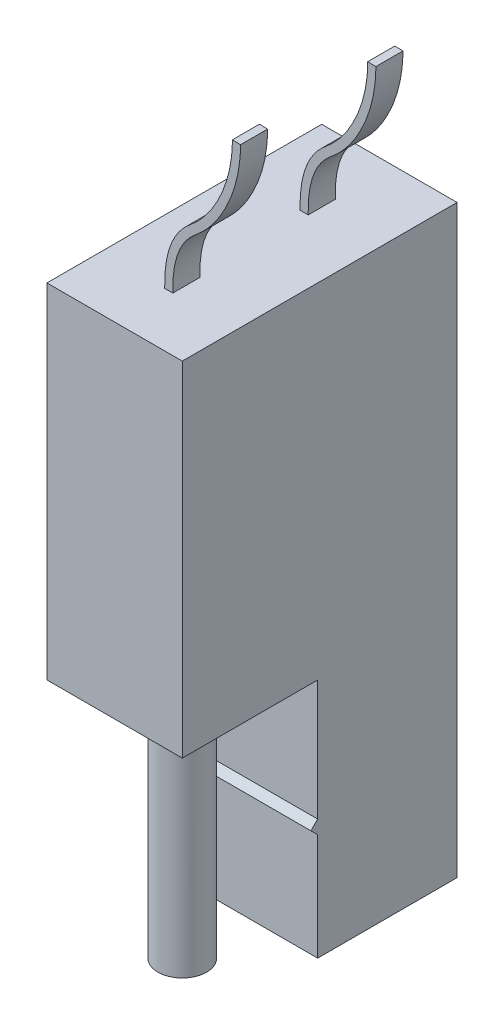
ISO-10303-21;
HEADER;
FILE_DESCRIPTION(('STEP AP214'),'2;1');
FILE_NAME('part.step','',(''),(''),'','','');
FILE_SCHEMA(('AUTOMOTIVE_DESIGN { 1 0 10303 214 1 1 1 1 }'));
ENDSEC;
DATA;
#1=APPLICATION_CONTEXT('core data for automotive mechanical design processes');
#2=APPLICATION_PROTOCOL_DEFINITION('international standard','automotive_design',2000,#1);
#3=PRODUCT_CONTEXT('',#1,'mechanical');
#4=PRODUCT('Part','Part','',(#3));
#5=PRODUCT_RELATED_PRODUCT_CATEGORY('part','',(#4));
#6=PRODUCT_DEFINITION_FORMATION('','',#4);
#7=PRODUCT_DEFINITION_CONTEXT('part definition',#1,'design');
#8=PRODUCT_DEFINITION('design','',#6,#7);
#9=PRODUCT_DEFINITION_SHAPE('','',#8);
#10=(LENGTH_UNIT() NAMED_UNIT(*) SI_UNIT(.MILLI.,.METRE.));
#11=(NAMED_UNIT(*) PLANE_ANGLE_UNIT() SI_UNIT($,.RADIAN.));
#12=(NAMED_UNIT(*) SI_UNIT($,.STERADIAN.) SOLID_ANGLE_UNIT());
#13=UNCERTAINTY_MEASURE_WITH_UNIT(LENGTH_MEASURE(1.E-05),#10,'distance_accuracy_value','');
#14=(GEOMETRIC_REPRESENTATION_CONTEXT(3) GLOBAL_UNCERTAINTY_ASSIGNED_CONTEXT((#13)) GLOBAL_UNIT_ASSIGNED_CONTEXT((#10,
#11,#12)) REPRESENTATION_CONTEXT('',''));
#15=CARTESIAN_POINT('',(0.,0.,0.));
#16=DIRECTION('',(0.,0.,1.));
#17=DIRECTION('',(1.,0.,0.));
#18=AXIS2_PLACEMENT_3D('',#15,#16,#17);
#19=CARTESIAN_POINT('',(0.,0.,1.03));
#20=DIRECTION('',(0.,0.,-1.));
#21=DIRECTION('',(-1.,0.,0.));
#22=AXIS2_PLACEMENT_3D('',#19,#20,#21);
#23=PLANE('',#22);
#24=DIRECTION('',(0.,1.,0.));
#25=VECTOR('',#24,1.);
#26=CARTESIAN_POINT('',(0.5,-2.16,1.03));
#27=LINE('',#26,#25);
#28=CARTESIAN_POINT('',(0.5,-2.16,1.03));
#29=VERTEX_POINT('',#28);
#30=CARTESIAN_POINT('',(0.5,-1.37,1.03));
#31=VERTEX_POINT('',#30);
#32=EDGE_CURVE('E64',#29,#31,#27,.T.);
#33=ORIENTED_EDGE('',*,*,#32,.T.);
#34=DIRECTION('',(1.,0.,0.));
#35=VECTOR('',#34,1.);
#36=CARTESIAN_POINT('',(-0.61180339887499,-1.37,1.03));
#37=LINE('',#36,#35);
#38=CARTESIAN_POINT('',(-0.5,-1.37,1.03));
#39=VERTEX_POINT('',#38);
#40=EDGE_CURVE('E171',#39,#31,#37,.T.);
#41=ORIENTED_EDGE('',*,*,#40,.F.);
#42=DIRECTION('',(0.,-1.,0.));
#43=VECTOR('',#42,1.);
#44=CARTESIAN_POINT('',(-0.5,-2.16,1.03));
#45=LINE('',#44,#43);
#46=CARTESIAN_POINT('',(-0.5,-2.16,1.03));
#47=VERTEX_POINT('',#46);
#48=EDGE_CURVE('E308',#39,#47,#45,.T.);
#49=ORIENTED_EDGE('',*,*,#48,.T.);
#50=DIRECTION('',(1.,0.,0.));
#51=VECTOR('',#50,1.);
#52=CARTESIAN_POINT('',(-0.5,-2.16,1.03));
#53=LINE('',#52,#51);
#54=EDGE_CURVE('E307',#47,#29,#53,.T.);
#55=ORIENTED_EDGE('',*,*,#54,.T.);
#56=EDGE_LOOP('',(#33,#41,#49,#55));
#57=FACE_BOUND('',#56,.T.);
#58=ADVANCED_FACE('F41',(#57),#23,.F.);
#59=CARTESIAN_POINT('',(-0.5,2.16,2.03));
#60=DIRECTION('',(0.,-1.,0.));
#61=DIRECTION('',(0.,0.,-1.));
#62=AXIS2_PLACEMENT_3D('',#59,#60,#61);
#63=PLANE('',#62);
#64=DIRECTION('',(-1.,0.,0.));
#65=VECTOR('',#64,1.);
#66=CARTESIAN_POINT('',(-0.0299999999999999,2.16,0.629999999999999));
#67=LINE('',#66,#65);
#68=CARTESIAN_POINT('',(-0.0299999999999999,2.16,0.629999999999999));
#69=VERTEX_POINT('',#68);
#70=CARTESIAN_POINT('',(0.0300000000000001,2.16,0.629999999999999));
#71=VERTEX_POINT('',#70);
#72=EDGE_CURVE('E190',#69,#71,#67,.F.);
#73=ORIENTED_EDGE('',*,*,#72,.F.);
#74=DIRECTION('',(0.,0.,-1.));
#75=VECTOR('',#74,1.);
#76=CARTESIAN_POINT('',(-0.0299999999999999,2.16,0.429999999999999));
#77=LINE('',#76,#75);
#78=CARTESIAN_POINT('',(-0.0299999999999999,2.16,0.429999999999999));
#79=VERTEX_POINT('',#78);
#80=EDGE_CURVE('E188',#79,#69,#77,.F.);
#81=ORIENTED_EDGE('',*,*,#80,.F.);
#82=DIRECTION('',(1.,0.,0.));
#83=VECTOR('',#82,1.);
#84=CARTESIAN_POINT('',(-0.0299999999999999,2.16,0.429999999999999));
#85=LINE('',#84,#83);
#86=CARTESIAN_POINT('',(0.0300000000000001,2.16,0.429999999999999));
#87=VERTEX_POINT('',#86);
#88=EDGE_CURVE('E209',#87,#79,#85,.F.);
#89=ORIENTED_EDGE('',*,*,#88,.F.);
#90=DIRECTION('',(0.,0.,1.));
#91=VECTOR('',#90,1.);
#92=CARTESIAN_POINT('',(0.0300000000000001,2.16,0.429999999999999));
#93=LINE('',#92,#91);
#94=EDGE_CURVE('E214',#71,#87,#93,.F.);
#95=ORIENTED_EDGE('',*,*,#94,.F.);
#96=EDGE_LOOP('',(#73,#81,#89,#95));
#97=FACE_BOUND('',#96,.T.);
#98=DIRECTION('',(-1.,0.,0.));
#99=VECTOR('',#98,1.);
#100=CARTESIAN_POINT('',(-0.5,2.16,0.));
#101=LINE('',#100,#99);
#102=CARTESIAN_POINT('',(0.5,2.16,0.));
#103=VERTEX_POINT('',#102);
#104=CARTESIAN_POINT('',(-0.5,2.16,0.));
#105=VERTEX_POINT('',#104);
#106=EDGE_CURVE('E332',#103,#105,#101,.T.);
#107=ORIENTED_EDGE('',*,*,#106,.T.);
#108=DIRECTION('',(0.,0.,-1.));
#109=VECTOR('',#108,1.);
#110=CARTESIAN_POINT('',(-0.5,2.16,2.03));
#111=LINE('',#110,#109);
#112=CARTESIAN_POINT('',(-0.5,2.16,2.03));
#113=VERTEX_POINT('',#112);
#114=EDGE_CURVE('E342',#113,#105,#111,.T.);
#115=ORIENTED_EDGE('',*,*,#114,.F.);
#116=DIRECTION('',(-1.,0.,0.));
#117=VECTOR('',#116,1.);
#118=CARTESIAN_POINT('',(-0.5,2.16,2.03));
#119=LINE('',#118,#117);
#120=CARTESIAN_POINT('',(0.5,2.16,2.03));
#121=VERTEX_POINT('',#120);
#122=EDGE_CURVE('E323',#121,#113,#119,.T.);
#123=ORIENTED_EDGE('',*,*,#122,.F.);
#124=DIRECTION('',(0.,0.,-1.));
#125=VECTOR('',#124,1.);
#126=CARTESIAN_POINT('',(0.5,2.16,2.03));
#127=LINE('',#126,#125);
#128=EDGE_CURVE('E49',#121,#103,#127,.T.);
#129=ORIENTED_EDGE('',*,*,#128,.T.);
#130=EDGE_LOOP('',(#107,#115,#123,#129));
#131=FACE_BOUND('',#130,.T.);
#132=DIRECTION('',(0.,0.,-1.));
#133=VECTOR('',#132,1.);
#134=CARTESIAN_POINT('',(0.0300000000000001,2.16,1.63));
#135=LINE('',#134,#133);
#136=CARTESIAN_POINT('',(0.0300000000000001,2.16,1.63));
#137=VERTEX_POINT('',#136);
#138=CARTESIAN_POINT('',(0.0300000000000001,2.16,1.43));
#139=VERTEX_POINT('',#138);
#140=EDGE_CURVE('E237',#137,#139,#135,.T.);
#141=ORIENTED_EDGE('',*,*,#140,.F.);
#142=DIRECTION('',(1.,0.,0.));
#143=VECTOR('',#142,1.);
#144=CARTESIAN_POINT('',(-0.0299999999999999,2.16,1.63));
#145=LINE('',#144,#143);
#146=CARTESIAN_POINT('',(-0.0299999999999999,2.16,1.63));
#147=VERTEX_POINT('',#146);
#148=EDGE_CURVE('E259',#147,#137,#145,.T.);
#149=ORIENTED_EDGE('',*,*,#148,.F.);
#150=DIRECTION('',(0.,0.,1.));
#151=VECTOR('',#150,1.);
#152=CARTESIAN_POINT('',(-0.0299999999999999,2.16,1.63));
#153=LINE('',#152,#151);
#154=CARTESIAN_POINT('',(-0.0299999999999999,2.16,1.43));
#155=VERTEX_POINT('',#154);
#156=EDGE_CURVE('E265',#155,#147,#153,.T.);
#157=ORIENTED_EDGE('',*,*,#156,.F.);
#158=DIRECTION('',(-1.,0.,0.));
#159=VECTOR('',#158,1.);
#160=CARTESIAN_POINT('',(-0.0299999999999999,2.16,1.43));
#161=LINE('',#160,#159);
#162=EDGE_CURVE('E240',#139,#155,#161,.T.);
#163=ORIENTED_EDGE('',*,*,#162,.F.);
#164=EDGE_LOOP('',(#141,#149,#157,#163));
#165=FACE_BOUND('',#164,.T.);
#166=ADVANCED_FACE('F348',(#97,#131,#165),#63,.F.);
#167=CARTESIAN_POINT('',(0.5,-2.16,2.03));
#168=DIRECTION('',(-1.,0.,0.));
#169=DIRECTION('',(0.,0.,1.));
#170=AXIS2_PLACEMENT_3D('',#167,#168,#169);
#171=PLANE('',#170);
#172=DIRECTION('',(0.,1.,0.));
#173=VECTOR('',#172,1.);
#174=CARTESIAN_POINT('',(0.5,-2.16,2.03));
#175=LINE('',#174,#173);
#176=CARTESIAN_POINT('',(0.5,-0.38,2.03));
#177=VERTEX_POINT('',#176);
#178=EDGE_CURVE('E321',#177,#121,#175,.T.);
#179=ORIENTED_EDGE('',*,*,#178,.F.);
#180=DIRECTION('',(0.,0.,1.));
#181=VECTOR('',#180,1.);
#182=CARTESIAN_POINT('',(0.5,-0.38,1.03));
#183=LINE('',#182,#181);
#184=CARTESIAN_POINT('',(0.5,-0.38,1.03));
#185=VERTEX_POINT('',#184);
#186=EDGE_CURVE('E314',#185,#177,#183,.T.);
#187=ORIENTED_EDGE('',*,*,#186,.F.);
#188=CARTESIAN_POINT('',(0.5,-1.27,1.03));
#189=VERTEX_POINT('',#188);
#190=EDGE_CURVE('E178',#189,#185,#27,.T.);
#191=ORIENTED_EDGE('',*,*,#190,.F.);
#192=DIRECTION('',(0.,-0.707106781186546,0.707106781186549));
#193=VECTOR('',#192,1.);
#194=CARTESIAN_POINT('',(0.5,-1.27,1.03));
#195=LINE('',#194,#193);
#196=CARTESIAN_POINT('',(0.5,-1.32,1.08));
#197=VERTEX_POINT('',#196);
#198=EDGE_CURVE('E165',#189,#197,#195,.T.);
#199=ORIENTED_EDGE('',*,*,#198,.T.);
#200=DIRECTION('',(0.,-0.707106781186546,-0.707106781186549));
#201=VECTOR('',#200,1.);
#202=CARTESIAN_POINT('',(0.5,-1.32,1.08));
#203=LINE('',#202,#201);
#204=EDGE_CURVE('E176',#197,#31,#203,.T.);
#205=ORIENTED_EDGE('',*,*,#204,.T.);
#206=ORIENTED_EDGE('',*,*,#32,.F.);
#207=DIRECTION('',(0.,0.,-1.));
#208=VECTOR('',#207,1.);
#209=CARTESIAN_POINT('',(0.5,-2.16,2.03));
#210=LINE('',#209,#208);
#211=CARTESIAN_POINT('',(0.5,-2.16,0.));
#212=VERTEX_POINT('',#211);
#213=EDGE_CURVE('E329',#29,#212,#210,.T.);
#214=ORIENTED_EDGE('',*,*,#213,.T.);
#215=DIRECTION('',(0.,1.,0.));
#216=VECTOR('',#215,1.);
#217=CARTESIAN_POINT('',(0.5,-2.16,0.));
#218=LINE('',#217,#216);
#219=EDGE_CURVE('E319',#212,#103,#218,.T.);
#220=ORIENTED_EDGE('',*,*,#219,.T.);
#221=ORIENTED_EDGE('',*,*,#128,.F.);
#222=EDGE_LOOP('',(#179,#187,#191,#199,#205,#206,#214,#220,#221));
#223=FACE_BOUND('',#222,.T.);
#224=ADVANCED_FACE('F43',(#223),#171,.F.);
#225=CARTESIAN_POINT('',(-0.5,-2.16,2.03));
#226=DIRECTION('',(1.,0.,0.));
#227=DIRECTION('',(0.,0.,-1.));
#228=AXIS2_PLACEMENT_3D('',#225,#226,#227);
#229=PLANE('',#228);
#230=CARTESIAN_POINT('',(-0.5,-0.38,1.03));
#231=VERTEX_POINT('',#230);
#232=CARTESIAN_POINT('',(-0.5,-1.27,1.03));
#233=VERTEX_POINT('',#232);
#234=EDGE_CURVE('E305',#231,#233,#45,.T.);
#235=ORIENTED_EDGE('',*,*,#234,.F.);
#236=DIRECTION('',(0.,0.,1.));
#237=VECTOR('',#236,1.);
#238=CARTESIAN_POINT('',(-0.5,-0.38,1.03));
#239=LINE('',#238,#237);
#240=CARTESIAN_POINT('',(-0.5,-0.38,2.03));
#241=VERTEX_POINT('',#240);
#242=EDGE_CURVE('E316',#231,#241,#239,.T.);
#243=ORIENTED_EDGE('',*,*,#242,.T.);
#244=DIRECTION('',(0.,-1.,0.));
#245=VECTOR('',#244,1.);
#246=CARTESIAN_POINT('',(-0.5,-2.16,2.03));
#247=LINE('',#246,#245);
#248=EDGE_CURVE('E326',#113,#241,#247,.T.);
#249=ORIENTED_EDGE('',*,*,#248,.F.);
#250=ORIENTED_EDGE('',*,*,#114,.T.);
#251=DIRECTION('',(0.,-1.,0.));
#252=VECTOR('',#251,1.);
#253=CARTESIAN_POINT('',(-0.5,-2.16,0.));
#254=LINE('',#253,#252);
#255=CARTESIAN_POINT('',(-0.5,-2.16,0.));
#256=VERTEX_POINT('',#255);
#257=EDGE_CURVE('E334',#105,#256,#254,.T.);
#258=ORIENTED_EDGE('',*,*,#257,.T.);
#259=DIRECTION('',(0.,0.,-1.));
#260=VECTOR('',#259,1.);
#261=CARTESIAN_POINT('',(-0.5,-2.16,2.03));
#262=LINE('',#261,#260);
#263=EDGE_CURVE('E340',#47,#256,#262,.T.);
#264=ORIENTED_EDGE('',*,*,#263,.F.);
#265=ORIENTED_EDGE('',*,*,#48,.F.);
#266=DIRECTION('',(0.,0.707106781186546,0.707106781186549));
#267=VECTOR('',#266,1.);
#268=CARTESIAN_POINT('',(-0.5,-1.32,1.08));
#269=LINE('',#268,#267);
#270=CARTESIAN_POINT('',(-0.5,-1.32,1.08));
#271=VERTEX_POINT('',#270);
#272=EDGE_CURVE('E185',#39,#271,#269,.T.);
#273=ORIENTED_EDGE('',*,*,#272,.T.);
#274=DIRECTION('',(0.,0.707106781186546,-0.707106781186549));
#275=VECTOR('',#274,1.);
#276=CARTESIAN_POINT('',(-0.5,-1.27,1.03));
#277=LINE('',#276,#275);
#278=EDGE_CURVE('E167',#271,#233,#277,.T.);
#279=ORIENTED_EDGE('',*,*,#278,.T.);
#280=EDGE_LOOP('',(#235,#243,#249,#250,#258,#264,#265,#273,#279));
#281=FACE_BOUND('',#280,.T.);
#282=ADVANCED_FACE('F360',(#281),#229,.F.);
#283=CARTESIAN_POINT('',(-0.5,-2.16,2.03));
#284=DIRECTION('',(0.,1.,0.));
#285=DIRECTION('',(0.,0.,1.));
#286=AXIS2_PLACEMENT_3D('',#283,#284,#285);
#287=PLANE('',#286);
#288=CARTESIAN_POINT('',(0.,-2.16,0.53));
#289=DIRECTION('',(0.,-1.,0.));
#290=DIRECTION('',(0.,0.,-1.));
#291=AXIS2_PLACEMENT_3D('',#288,#289,#290);
#292=CIRCLE('',#291,0.19);
#293=CARTESIAN_POINT('',(0.,-2.16,0.34));
#294=VERTEX_POINT('',#293);
#295=EDGE_CURVE('E290',#294,#294,#292,.T.);
#296=ORIENTED_EDGE('',*,*,#295,.F.);
#297=EDGE_LOOP('',(#296));
#298=FACE_BOUND('',#297,.T.);
#299=ORIENTED_EDGE('',*,*,#213,.F.);
#300=ORIENTED_EDGE('',*,*,#54,.F.);
#301=ORIENTED_EDGE('',*,*,#263,.T.);
#302=DIRECTION('',(1.,0.,0.));
#303=VECTOR('',#302,1.);
#304=CARTESIAN_POINT('',(-0.5,-2.16,0.));
#305=LINE('',#304,#303);
#306=EDGE_CURVE('E324',#256,#212,#305,.T.);
#307=ORIENTED_EDGE('',*,*,#306,.T.);
#308=EDGE_LOOP('',(#299,#300,#301,#307));
#309=FACE_BOUND('',#308,.T.);
#310=ADVANCED_FACE('F517',(#298,#309),#287,.F.);
#311=CARTESIAN_POINT('',(0.,0.,2.03));
#312=DIRECTION('',(0.,0.,-1.));
#313=DIRECTION('',(-1.,0.,0.));
#314=AXIS2_PLACEMENT_3D('',#311,#312,#313);
#315=PLANE('',#314);
#316=ORIENTED_EDGE('',*,*,#248,.T.);
#317=DIRECTION('',(-1.,0.,0.));
#318=VECTOR('',#317,1.);
#319=CARTESIAN_POINT('',(-0.5,-0.38,2.03));
#320=LINE('',#319,#318);
#321=EDGE_CURVE('E302',#177,#241,#320,.T.);
#322=ORIENTED_EDGE('',*,*,#321,.F.);
#323=ORIENTED_EDGE('',*,*,#178,.T.);
#324=ORIENTED_EDGE('',*,*,#122,.T.);
#325=EDGE_LOOP('',(#316,#322,#323,#324));
#326=FACE_BOUND('',#325,.T.);
#327=ADVANCED_FACE('F364',(#326),#315,.F.);
#328=CARTESIAN_POINT('',(0.,0.,0.));
#329=DIRECTION('',(0.,0.,-1.));
#330=DIRECTION('',(-1.,0.,0.));
#331=AXIS2_PLACEMENT_3D('',#328,#329,#330);
#332=PLANE('',#331);
#333=ORIENTED_EDGE('',*,*,#219,.F.);
#334=ORIENTED_EDGE('',*,*,#306,.F.);
#335=ORIENTED_EDGE('',*,*,#257,.F.);
#336=ORIENTED_EDGE('',*,*,#106,.F.);
#337=EDGE_LOOP('',(#333,#334,#335,#336));
#338=FACE_BOUND('',#337,.T.);
#339=ADVANCED_FACE('F355',(#338),#332,.T.);
#340=CARTESIAN_POINT('',(-0.5,-0.38,1.03));
#341=DIRECTION('',(0.,1.,0.));
#342=DIRECTION('',(0.,0.,1.));
#343=AXIS2_PLACEMENT_3D('',#340,#341,#342);
#344=PLANE('',#343);
#345=CARTESIAN_POINT('',(0.,-0.38,1.53));
#346=DIRECTION('',(0.,1.,0.));
#347=DIRECTION('',(0.,0.,1.));
#348=AXIS2_PLACEMENT_3D('',#345,#346,#347);
#349=CIRCLE('',#348,0.179640036480426);
#350=CARTESIAN_POINT('',(0.,-0.38,1.70964003648043));
#351=VERTEX_POINT('',#350);
#352=EDGE_CURVE('E11',#351,#351,#349,.F.);
#353=ORIENTED_EDGE('',*,*,#352,.F.);
#354=EDGE_LOOP('',(#353));
#355=FACE_BOUND('',#354,.T.);
#356=ORIENTED_EDGE('',*,*,#321,.T.);
#357=ORIENTED_EDGE('',*,*,#242,.F.);
#358=DIRECTION('',(-1.,0.,0.));
#359=VECTOR('',#358,1.);
#360=CARTESIAN_POINT('',(-0.5,-0.38,1.03));
#361=LINE('',#360,#359);
#362=EDGE_CURVE('E311',#185,#231,#361,.T.);
#363=ORIENTED_EDGE('',*,*,#362,.F.);
#364=ORIENTED_EDGE('',*,*,#186,.T.);
#365=EDGE_LOOP('',(#356,#357,#363,#364));
#366=FACE_BOUND('',#365,.T.);
#367=ADVANCED_FACE('F367',(#355,#366),#344,.F.);
#368=ORIENTED_EDGE('',*,*,#234,.T.);
#369=DIRECTION('',(1.,0.,0.));
#370=VECTOR('',#369,1.);
#371=CARTESIAN_POINT('',(-0.61180339887499,-1.27,1.03));
#372=LINE('',#371,#370);
#373=EDGE_CURVE('E56',#233,#189,#372,.T.);
#374=ORIENTED_EDGE('',*,*,#373,.T.);
#375=ORIENTED_EDGE('',*,*,#190,.T.);
#376=ORIENTED_EDGE('',*,*,#362,.T.);
#377=EDGE_LOOP('',(#368,#374,#375,#376));
#378=FACE_BOUND('',#377,.T.);
#379=ADVANCED_FACE('F368',(#378),#23,.F.);
#380=CARTESIAN_POINT('',(0.,-2.16,1.53));
#381=DIRECTION('',(0.,1.,0.));
#382=DIRECTION('',(0.,0.,1.));
#383=AXIS2_PLACEMENT_3D('',#380,#381,#382);
#384=CYLINDRICAL_SURFACE('',#383,0.141754663678598);
#385=CARTESIAN_POINT('',(0.,-2.16,1.53));
#386=DIRECTION('',(0.,-1.,0.));
#387=DIRECTION('',(0.,0.,-1.));
#388=AXIS2_PLACEMENT_3D('',#385,#386,#387);
#389=CIRCLE('',#388,0.141754663678598);
#390=CARTESIAN_POINT('',(0.,-2.16,1.3882453363214));
#391=VERTEX_POINT('',#390);
#392=EDGE_CURVE('E296',#391,#391,#389,.T.);
#393=ORIENTED_EDGE('',*,*,#392,.T.);
#394=EDGE_LOOP('',(#393));
#395=FACE_BOUND('',#394,.T.);
#396=CARTESIAN_POINT('',(0.,-0.38,1.53));
#397=DIRECTION('',(0.,-1.,0.));
#398=DIRECTION('',(0.,0.,-1.));
#399=AXIS2_PLACEMENT_3D('',#396,#397,#398);
#400=CIRCLE('',#399,0.141754663678598);
#401=CARTESIAN_POINT('',(0.,-0.38,1.3882453363214));
#402=VERTEX_POINT('',#401);
#403=EDGE_CURVE('E293',#402,#402,#400,.T.);
#404=ORIENTED_EDGE('',*,*,#403,.F.);
#405=EDGE_LOOP('',(#404));
#406=FACE_BOUND('',#405,.T.);
#407=ADVANCED_FACE('F379',(#395,#406),#384,.F.);
#408=CARTESIAN_POINT('',(0.,-2.16,1.53));
#409=DIRECTION('',(0.,1.,0.));
#410=DIRECTION('',(0.,0.,1.));
#411=AXIS2_PLACEMENT_3D('',#408,#409,#410);
#412=CYLINDRICAL_SURFACE('',#411,0.179640036480426);
#413=CARTESIAN_POINT('',(0.,-2.16,1.53));
#414=DIRECTION('',(0.,-1.,0.));
#415=DIRECTION('',(0.,0.,-1.));
#416=AXIS2_PLACEMENT_3D('',#413,#414,#415);
#417=CIRCLE('',#416,0.179640036480426);
#418=CARTESIAN_POINT('',(0.,-2.16,1.35035996351957));
#419=VERTEX_POINT('',#418);
#420=EDGE_CURVE('E299',#419,#419,#417,.T.);
#421=ORIENTED_EDGE('',*,*,#420,.F.);
#422=EDGE_LOOP('',(#421));
#423=FACE_BOUND('',#422,.T.);
#424=ORIENTED_EDGE('',*,*,#352,.T.);
#425=EDGE_LOOP('',(#424));
#426=FACE_BOUND('',#425,.T.);
#427=ADVANCED_FACE('F384',(#423,#426),#412,.T.);
#428=CARTESIAN_POINT('',(0.,-2.16,0.));
#429=DIRECTION('',(0.,-1.,0.));
#430=DIRECTION('',(0.,0.,-1.));
#431=AXIS2_PLACEMENT_3D('',#428,#429,#430);
#432=PLANE('',#431);
#433=ORIENTED_EDGE('',*,*,#392,.F.);
#434=EDGE_LOOP('',(#433));
#435=FACE_BOUND('',#434,.T.);
#436=ORIENTED_EDGE('',*,*,#420,.T.);
#437=EDGE_LOOP('',(#436));
#438=FACE_BOUND('',#437,.T.);
#439=ADVANCED_FACE('F396',(#435,#438),#432,.T.);
#440=ORIENTED_EDGE('',*,*,#403,.T.);
#441=EDGE_LOOP('',(#440));
#442=FACE_BOUND('',#441,.T.);
#443=ADVANCED_FACE('F387',(#442),#344,.F.);
#444=CARTESIAN_POINT('',(0.,-2.16,0.53));
#445=DIRECTION('',(0.,1.,0.));
#446=DIRECTION('',(0.,0.,1.));
#447=AXIS2_PLACEMENT_3D('',#444,#445,#446);
#448=CYLINDRICAL_SURFACE('',#447,0.19);
#449=ORIENTED_EDGE('',*,*,#295,.T.);
#450=EDGE_LOOP('',(#449));
#451=FACE_BOUND('',#450,.T.);
#452=CARTESIAN_POINT('',(0.,-0.38,0.53));
#453=DIRECTION('',(0.,-1.,0.));
#454=DIRECTION('',(0.,0.,-1.));
#455=AXIS2_PLACEMENT_3D('',#452,#453,#454);
#456=CIRCLE('',#455,0.19);
#457=CARTESIAN_POINT('',(0.,-0.38,0.34));
#458=VERTEX_POINT('',#457);
#459=EDGE_CURVE('E289',#458,#458,#456,.T.);
#460=ORIENTED_EDGE('',*,*,#459,.F.);
#461=EDGE_LOOP('',(#460));
#462=FACE_BOUND('',#461,.T.);
#463=ADVANCED_FACE('F395',(#451,#462),#448,.F.);
#464=CARTESIAN_POINT('',(0.,-0.38,0.));
#465=DIRECTION('',(0.,-1.,0.));
#466=DIRECTION('',(0.,0.,-1.));
#467=AXIS2_PLACEMENT_3D('',#464,#465,#466);
#468=PLANE('',#467);
#469=ORIENTED_EDGE('',*,*,#459,.T.);
#470=EDGE_LOOP('',(#469));
#471=FACE_BOUND('',#470,.T.);
#472=ADVANCED_FACE('F402',(#471),#468,.T.);
#473=CARTESIAN_POINT('',(0.5,3.36,0.));
#474=DIRECTION('',(-0.026091500084732,-0.99965955886158,0.));
#475=DIRECTION('',(0.,0.,-1.));
#476=AXIS2_PLACEMENT_3D('',#473,#474,#475);
#477=PLANE('',#476);
#478=DIRECTION('',(0.,0.,-1.));
#479=VECTOR('',#478,1.);
#480=CARTESIAN_POINT('',(0.529989786765847,3.35921725499746,1.63));
#481=LINE('',#480,#479);
#482=CARTESIAN_POINT('',(0.529989786765847,3.35921725499746,1.63));
#483=VERTEX_POINT('',#482);
#484=CARTESIAN_POINT('',(0.529989786765847,3.35921725499746,1.43));
#485=VERTEX_POINT('',#484);
#486=EDGE_CURVE('E241',#483,#485,#481,.T.);
#487=ORIENTED_EDGE('',*,*,#486,.T.);
#488=DIRECTION('',(-0.99965955886158,0.026091500084732,0.));
#489=VECTOR('',#488,1.);
#490=CARTESIAN_POINT('',(0.470010213234153,3.36078274500255,1.43));
#491=LINE('',#490,#489);
#492=CARTESIAN_POINT('',(0.470010213234153,3.36078274500255,1.43));
#493=VERTEX_POINT('',#492);
#494=EDGE_CURVE('E243',#485,#493,#491,.T.);
#495=ORIENTED_EDGE('',*,*,#494,.T.);
#496=DIRECTION('',(0.,0.,1.));
#497=VECTOR('',#496,1.);
#498=CARTESIAN_POINT('',(0.470010213234153,3.36078274500255,1.63));
#499=LINE('',#498,#497);
#500=CARTESIAN_POINT('',(0.470010213234153,3.36078274500255,1.63));
#501=VERTEX_POINT('',#500);
#502=EDGE_CURVE('E267',#493,#501,#499,.T.);
#503=ORIENTED_EDGE('',*,*,#502,.T.);
#504=DIRECTION('',(0.99965955886158,-0.026091500084732,0.));
#505=VECTOR('',#504,1.);
#506=CARTESIAN_POINT('',(0.470010213234153,3.36078274500255,1.63));
#507=LINE('',#506,#505);
#508=EDGE_CURVE('E278',#501,#483,#507,.T.);
#509=ORIENTED_EDGE('',*,*,#508,.T.);
#510=EDGE_LOOP('',(#487,#495,#503,#509));
#511=FACE_BOUND('',#510,.T.);
#512=ADVANCED_FACE('F419',(#511),#477,.F.);
#513=CARTESIAN_POINT('',(0.0300000000000001,2.16,1.63));
#514=CARTESIAN_POINT('',(0.0266892374198707,2.28349427453024,1.63));
#515=CARTESIAN_POINT('',(0.0448383733443793,2.37483699548692,1.63));
#516=CARTESIAN_POINT('',(0.099503530397973,2.51267903592151,1.63));
#517=CARTESIAN_POINT('',(0.135974255175685,2.55940122146133,1.62999999999999));
#518=CARTESIAN_POINT('',(0.192448919305238,2.61375157852386,1.63000000000001));
#519=CARTESIAN_POINT('',(0.21416171788574,2.6302479196121,1.63));
#520=CARTESIAN_POINT('',(0.305479677823542,2.71371956322376,1.62999999999999));
#521=CARTESIAN_POINT('',(0.37781611150346,2.80815353033428,1.63));
#522=CARTESIAN_POINT('',(0.490125853022517,3.04884014297377,1.63));
#523=CARTESIAN_POINT('',(0.529863618645226,3.19509965607411,1.63000000000021));
#524=CARTESIAN_POINT('',(0.529989786765847,3.35921725499746,1.63));
#525=CARTESIAN_POINT('',(0.0300000000000001,2.16,1.43));
#526=CARTESIAN_POINT('',(0.0266892374198703,2.28349427453024,1.43));
#527=CARTESIAN_POINT('',(0.0448383733443793,2.37483699548692,1.43));
#528=CARTESIAN_POINT('',(0.099503530397973,2.51267903592151,1.43));
#529=CARTESIAN_POINT('',(0.135974255175707,2.55940122146137,1.42999999999999));
#530=CARTESIAN_POINT('',(0.192448919305225,2.61375157852384,1.43000000000001));
#531=CARTESIAN_POINT('',(0.21416171788574,2.6302479196121,1.43));
#532=CARTESIAN_POINT('',(0.305479677823542,2.71371956322376,1.42999999999999));
#533=CARTESIAN_POINT('',(0.37781611150346,2.80815353033428,1.43));
#534=CARTESIAN_POINT('',(0.490125853022517,3.04884014297377,1.43));
#535=CARTESIAN_POINT('',(0.529863618645226,3.19509965607411,1.43000000000021));
#536=CARTESIAN_POINT('',(0.529989786765847,3.35921725499746,1.43));
#537=B_SPLINE_SURFACE_WITH_KNOTS('',1,3,((#513,#514,#515,#516,#517,#518,#519,#520,#521,#522,
#523,#524),(#525,#526,#527,#528,#529,#530,#531,#532,#533,#534,#535,#536)),.UNSPECIFIED.,.F.,.F.,
.F.,(2,2),(4,2,2,2,2,4),(0.,1.),(0.,0.169944184867651,0.339888369735301,0.439888369735405,
0.719944184867703,1.),.UNSPECIFIED.);
#538=CARTESIAN_POINT('',(0.0300000000000001,2.16,1.43));
#539=CARTESIAN_POINT('',(0.0266892374198703,2.28349427453024,1.43));
#540=CARTESIAN_POINT('',(0.0448383733443793,2.37483699548692,1.43));
#541=CARTESIAN_POINT('',(0.099503530397973,2.51267903592151,1.43));
#542=CARTESIAN_POINT('',(0.135974255175707,2.55940122146137,1.42999999999999));
#543=CARTESIAN_POINT('',(0.192448919305225,2.61375157852384,1.43000000000001));
#544=CARTESIAN_POINT('',(0.21416171788574,2.6302479196121,1.43));
#545=CARTESIAN_POINT('',(0.305479677823542,2.71371956322376,1.42999999999999));
#546=CARTESIAN_POINT('',(0.37781611150346,2.80815353033428,1.43));
#547=CARTESIAN_POINT('',(0.490125853022517,3.04884014297377,1.43));
#548=CARTESIAN_POINT('',(0.529863618645226,3.19509965607411,1.43000000000021));
#549=CARTESIAN_POINT('',(0.529989786765847,3.35921725499746,1.43));
#550=B_SPLINE_CURVE_WITH_KNOTS('',3,(#538,#539,#540,#541,#542,#543,#544,#545,#546,#547,#548,
#549),.UNSPECIFIED.,.F.,.F.,(4,2,2,2,2,4),(0.,0.169944184867651,0.339888369735301,
0.439888369735405,0.719944184867703,1.),.UNSPECIFIED.);
#551=EDGE_CURVE('E245',#139,#485,#550,.T.);
#552=CARTESIAN_POINT('',(0.0300000000000001,2.16,1.63));
#553=CARTESIAN_POINT('',(0.0266892374198707,2.28349427453024,1.63));
#554=CARTESIAN_POINT('',(0.0448383733443793,2.37483699548692,1.63));
#555=CARTESIAN_POINT('',(0.099503530397973,2.51267903592151,1.63));
#556=CARTESIAN_POINT('',(0.135974255175685,2.55940122146133,1.62999999999999));
#557=CARTESIAN_POINT('',(0.192448919305238,2.61375157852386,1.63000000000001));
#558=CARTESIAN_POINT('',(0.21416171788574,2.6302479196121,1.63));
#559=CARTESIAN_POINT('',(0.305479677823542,2.71371956322376,1.62999999999999));
#560=CARTESIAN_POINT('',(0.37781611150346,2.80815353033428,1.63));
#561=CARTESIAN_POINT('',(0.490125853022517,3.04884014297377,1.63));
#562=CARTESIAN_POINT('',(0.529863618645226,3.19509965607411,1.63000000000021));
#563=CARTESIAN_POINT('',(0.529989786765847,3.35921725499746,1.63));
#564=B_SPLINE_CURVE_WITH_KNOTS('',3,(#552,#553,#554,#555,#556,#557,#558,#559,#560,#561,#562,
#563),.UNSPECIFIED.,.F.,.F.,(4,2,2,2,2,4),(0.,0.169944184867651,0.339888369735301,
0.439888369735405,0.719944184867703,1.),.UNSPECIFIED.);
#565=EDGE_CURVE('E251',#137,#483,#564,.T.);
#566=ORIENTED_EDGE('',*,*,#551,.T.);
#567=ORIENTED_EDGE('',*,*,#486,.F.);
#568=ORIENTED_EDGE('',*,*,#565,.F.);
#569=ORIENTED_EDGE('',*,*,#140,.T.);
#570=EDGE_LOOP('',(#566,#567,#568,#569));
#571=FACE_BOUND('',#570,.T.);
#572=ADVANCED_FACE('F424',(#571),#537,.T.);
#573=CARTESIAN_POINT('',(-0.0299999999999999,2.16,1.43));
#574=DIRECTION('',(0.,0.,1.));
#575=DIRECTION('',(1.,0.,0.));
#576=AXIS2_PLACEMENT_3D('',#573,#574,#575);
#577=PLANE('',#576);
#578=CARTESIAN_POINT('',(-0.0299999999999999,2.16,1.43));
#579=CARTESIAN_POINT('',(-0.0333077248411705,2.29008484622117,1.43));
#580=CARTESIAN_POINT('',(-0.013902459143975,2.39009895167865,1.43));
#581=CARTESIAN_POINT('',(0.047964170825791,2.54472753564696,1.43));
#582=CARTESIAN_POINT('',(0.0904714380948904,2.59911800496056,1.42999999999999));
#583=CARTESIAN_POINT('',(0.155080149694144,2.66087034831631,1.43000000000001));
#584=CARTESIAN_POINT('',(0.177270449142572,2.67768038800766,1.43));
#585=CARTESIAN_POINT('',(0.259162827206026,2.75295553147938,1.42999999999999));
#586=CARTESIAN_POINT('',(0.327574677510736,2.84186461802516,1.43));
#587=CARTESIAN_POINT('',(0.432943498367989,3.06860923509439,1.43));
#588=CARTESIAN_POINT('',(0.470136160667032,3.20643710016575,1.43000000000021));
#589=CARTESIAN_POINT('',(0.470010213234153,3.36078274500255,1.43));
#590=B_SPLINE_CURVE_WITH_KNOTS('',3,(#578,#579,#580,#581,#582,#583,#584,#585,#586,#587,#588,
#589),.UNSPECIFIED.,.F.,.F.,(4,2,2,2,2,4),(0.,0.169944184867651,0.339888369735301,
0.439888369735405,0.719944184867703,1.),.UNSPECIFIED.);
#591=EDGE_CURVE('E250',#155,#493,#590,.T.);
#592=ORIENTED_EDGE('',*,*,#591,.T.);
#593=ORIENTED_EDGE('',*,*,#494,.F.);
#594=ORIENTED_EDGE('',*,*,#551,.F.);
#595=ORIENTED_EDGE('',*,*,#162,.T.);
#596=EDGE_LOOP('',(#592,#593,#594,#595));
#597=FACE_BOUND('',#596,.T.);
#598=ADVANCED_FACE('F436',(#597),#577,.F.);
#599=CARTESIAN_POINT('',(-0.0299999999999999,2.16,1.43));
#600=CARTESIAN_POINT('',(-0.0333077248411705,2.29008484622117,1.43));
#601=CARTESIAN_POINT('',(-0.013902459143975,2.39009895167865,1.43));
#602=CARTESIAN_POINT('',(0.047964170825791,2.54472753564696,1.43));
#603=CARTESIAN_POINT('',(0.0904714380948904,2.59911800496056,1.42999999999999));
#604=CARTESIAN_POINT('',(0.155080149694144,2.66087034831631,1.43000000000001));
#605=CARTESIAN_POINT('',(0.177270449142572,2.67768038800766,1.43));
#606=CARTESIAN_POINT('',(0.259162827206026,2.75295553147938,1.42999999999999));
#607=CARTESIAN_POINT('',(0.327574677510736,2.84186461802516,1.43));
#608=CARTESIAN_POINT('',(0.432943498367989,3.06860923509439,1.43));
#609=CARTESIAN_POINT('',(0.470136160667032,3.20643710016575,1.43000000000021));
#610=CARTESIAN_POINT('',(0.470010213234153,3.36078274500255,1.43));
#611=CARTESIAN_POINT('',(-0.0299999999999999,2.16,1.63));
#612=CARTESIAN_POINT('',(-0.03330772484117,2.29008484622117,1.63));
#613=CARTESIAN_POINT('',(-0.013902459143975,2.39009895167865,1.63));
#614=CARTESIAN_POINT('',(0.047964170825791,2.54472753564696,1.63));
#615=CARTESIAN_POINT('',(0.0904714380948675,2.59911800496053,1.62999999999999));
#616=CARTESIAN_POINT('',(0.155080149694158,2.66087034831633,1.63000000000001));
#617=CARTESIAN_POINT('',(0.177270449142572,2.67768038800766,1.63));
#618=CARTESIAN_POINT('',(0.259162827206026,2.75295553147938,1.62999999999999));
#619=CARTESIAN_POINT('',(0.327574677510736,2.84186461802516,1.63));
#620=CARTESIAN_POINT('',(0.432943498367989,3.06860923509439,1.63));
#621=CARTESIAN_POINT('',(0.470136160667032,3.20643710016575,1.63000000000021));
#622=CARTESIAN_POINT('',(0.470010213234153,3.36078274500255,1.63));
#623=B_SPLINE_SURFACE_WITH_KNOTS('',1,3,((#599,#600,#601,#602,#603,#604,#605,#606,#607,#608,
#609,#610),(#611,#612,#613,#614,#615,#616,#617,#618,#619,#620,#621,#622)),.UNSPECIFIED.,.F.,.F.,
.F.,(2,2),(4,2,2,2,2,4),(0.,1.),(0.,0.169944184867651,0.339888369735301,0.439888369735405,
0.719944184867703,1.),.UNSPECIFIED.);
#624=CARTESIAN_POINT('',(-0.0299999999999999,2.16,1.63));
#625=CARTESIAN_POINT('',(-0.03330772484117,2.29008484622117,1.63));
#626=CARTESIAN_POINT('',(-0.013902459143975,2.39009895167865,1.63));
#627=CARTESIAN_POINT('',(0.047964170825791,2.54472753564696,1.63));
#628=CARTESIAN_POINT('',(0.0904714380948675,2.59911800496053,1.62999999999999));
#629=CARTESIAN_POINT('',(0.155080149694158,2.66087034831633,1.63000000000001));
#630=CARTESIAN_POINT('',(0.177270449142572,2.67768038800766,1.63));
#631=CARTESIAN_POINT('',(0.259162827206026,2.75295553147938,1.62999999999999));
#632=CARTESIAN_POINT('',(0.327574677510736,2.84186461802516,1.63));
#633=CARTESIAN_POINT('',(0.432943498367989,3.06860923509439,1.63));
#634=CARTESIAN_POINT('',(0.470136160667032,3.20643710016575,1.63000000000021));
#635=CARTESIAN_POINT('',(0.470010213234153,3.36078274500255,1.63));
#636=B_SPLINE_CURVE_WITH_KNOTS('',3,(#624,#625,#626,#627,#628,#629,#630,#631,#632,#633,#634,
#635),.UNSPECIFIED.,.F.,.F.,(4,2,2,2,2,4),(0.,0.169944184867651,0.339888369735301,
0.439888369735405,0.719944184867703,1.),.UNSPECIFIED.);
#637=EDGE_CURVE('E244',#147,#501,#636,.T.);
#638=ORIENTED_EDGE('',*,*,#637,.T.);
#639=ORIENTED_EDGE('',*,*,#502,.F.);
#640=ORIENTED_EDGE('',*,*,#591,.F.);
#641=ORIENTED_EDGE('',*,*,#156,.T.);
#642=EDGE_LOOP('',(#638,#639,#640,#641));
#643=FACE_BOUND('',#642,.T.);
#644=ADVANCED_FACE('F430',(#643),#623,.T.);
#645=CARTESIAN_POINT('',(-0.0299999999999999,2.16,1.63));
#646=DIRECTION('',(0.,0.,1.));
#647=DIRECTION('',(1.,0.,0.));
#648=AXIS2_PLACEMENT_3D('',#645,#646,#647);
#649=PLANE('',#648);
#650=ORIENTED_EDGE('',*,*,#508,.F.);
#651=ORIENTED_EDGE('',*,*,#637,.F.);
#652=ORIENTED_EDGE('',*,*,#148,.T.);
#653=ORIENTED_EDGE('',*,*,#565,.T.);
#654=EDGE_LOOP('',(#650,#651,#652,#653));
#655=FACE_BOUND('',#654,.T.);
#656=ADVANCED_FACE('F421',(#655),#649,.T.);
#657=CARTESIAN_POINT('',(0.5,3.36,2.06));
#658=DIRECTION('',(-0.026091500084732,-0.99965955886158,0.));
#659=DIRECTION('',(0.,0.,1.));
#660=AXIS2_PLACEMENT_3D('',#657,#658,#659);
#661=PLANE('',#660);
#662=DIRECTION('',(0.,0.,1.));
#663=VECTOR('',#662,1.);
#664=CARTESIAN_POINT('',(0.529989786765847,3.35921725499746,0.429999999999999));
#665=LINE('',#664,#663);
#666=CARTESIAN_POINT('',(0.529989786765847,3.35921725499746,0.629999999999999));
#667=VERTEX_POINT('',#666);
#668=CARTESIAN_POINT('',(0.529989786765847,3.35921725499746,0.429999999999999));
#669=VERTEX_POINT('',#668);
#670=EDGE_CURVE('E216',#667,#669,#665,.F.);
#671=ORIENTED_EDGE('',*,*,#670,.T.);
#672=DIRECTION('',(0.99965955886158,-0.026091500084732,0.));
#673=VECTOR('',#672,1.);
#674=CARTESIAN_POINT('',(0.470010213234153,3.36078274500255,0.429999999999999));
#675=LINE('',#674,#673);
#676=CARTESIAN_POINT('',(0.470010213234153,3.36078274500255,0.429999999999999));
#677=VERTEX_POINT('',#676);
#678=EDGE_CURVE('E227',#669,#677,#675,.F.);
#679=ORIENTED_EDGE('',*,*,#678,.T.);
#680=DIRECTION('',(0.,0.,-1.));
#681=VECTOR('',#680,1.);
#682=CARTESIAN_POINT('',(0.470010213234153,3.36078274500255,0.429999999999999));
#683=LINE('',#682,#681);
#684=CARTESIAN_POINT('',(0.470010213234153,3.36078274500255,0.629999999999999));
#685=VERTEX_POINT('',#684);
#686=EDGE_CURVE('E191',#677,#685,#683,.F.);
#687=ORIENTED_EDGE('',*,*,#686,.T.);
#688=DIRECTION('',(-0.99965955886158,0.026091500084732,0.));
#689=VECTOR('',#688,1.);
#690=CARTESIAN_POINT('',(0.470010213234153,3.36078274500255,0.629999999999999));
#691=LINE('',#690,#689);
#692=EDGE_CURVE('E193',#685,#667,#691,.F.);
#693=ORIENTED_EDGE('',*,*,#692,.T.);
#694=EDGE_LOOP('',(#671,#679,#687,#693));
#695=FACE_BOUND('',#694,.T.);
#696=ADVANCED_FACE('F429',(#695),#661,.F.);
#697=CARTESIAN_POINT('',(-0.0299999999999999,2.16,0.429999999999999));
#698=CARTESIAN_POINT('',(-0.0333077248411709,2.29008484622116,0.430000000000023));
#699=CARTESIAN_POINT('',(-0.013902459143975,2.39009895167865,0.429999999999999));
#700=CARTESIAN_POINT('',(0.047964170825791,2.54472753564696,0.429999999999999));
#701=CARTESIAN_POINT('',(0.0904714380948789,2.59911800496055,0.429999999999999));
#702=CARTESIAN_POINT('',(0.155080149694151,2.66087034831632,0.429999999999999));
#703=CARTESIAN_POINT('',(0.177270449142572,2.67768038800766,0.429999999999999));
#704=CARTESIAN_POINT('',(0.259162827206026,2.75295553147938,0.429999999999999));
#705=CARTESIAN_POINT('',(0.327574677510736,2.84186461802516,0.429999999999999));
#706=CARTESIAN_POINT('',(0.432943498367989,3.06860923509439,0.429999999999999));
#707=CARTESIAN_POINT('',(0.470136160667032,3.20643710016575,0.429999999999999));
#708=CARTESIAN_POINT('',(0.470010213234153,3.36078274500255,0.429999999999999));
#709=CARTESIAN_POINT('',(-0.0299999999999999,2.16,0.629999999999999));
#710=CARTESIAN_POINT('',(-0.0333077248411706,2.29008484622116,0.63000000000002));
#711=CARTESIAN_POINT('',(-0.013902459143975,2.39009895167865,0.629999999999999));
#712=CARTESIAN_POINT('',(0.047964170825791,2.54472753564696,0.629999999999999));
#713=CARTESIAN_POINT('',(0.0904714380948789,2.59911800496055,0.629999999999999));
#714=CARTESIAN_POINT('',(0.155080149694151,2.66087034831632,0.629999999999999));
#715=CARTESIAN_POINT('',(0.177270449142572,2.67768038800766,0.629999999999999));
#716=CARTESIAN_POINT('',(0.259162827206026,2.75295553147938,0.629999999999999));
#717=CARTESIAN_POINT('',(0.327574677510736,2.84186461802516,0.629999999999999));
#718=CARTESIAN_POINT('',(0.432943498367989,3.06860923509439,0.629999999999999));
#719=CARTESIAN_POINT('',(0.470136160667032,3.20643710016575,0.629999999999999));
#720=CARTESIAN_POINT('',(0.470010213234153,3.36078274500255,0.629999999999999));
#721=B_SPLINE_SURFACE_WITH_KNOTS('',1,3,((#697,#698,#699,#700,#701,#702,#703,#704,#705,#706,
#707,#708),(#709,#710,#711,#712,#713,#714,#715,#716,#717,#718,#719,#720)),.UNSPECIFIED.,.F.,.F.,
.F.,(2,2),(4,2,2,2,2,4),(0.,1.),(0.,0.169944184867651,0.339888369735301,0.439888369735405,
0.719944184867703,1.),.UNSPECIFIED.);
#722=CARTESIAN_POINT('',(-0.0299999999999999,2.16,0.629999999999999));
#723=CARTESIAN_POINT('',(-0.0333077248411706,2.29008484622116,0.63000000000002));
#724=CARTESIAN_POINT('',(-0.013902459143975,2.39009895167865,0.629999999999999));
#725=CARTESIAN_POINT('',(0.047964170825791,2.54472753564696,0.629999999999999));
#726=CARTESIAN_POINT('',(0.0904714380948789,2.59911800496055,0.629999999999999));
#727=CARTESIAN_POINT('',(0.155080149694151,2.66087034831632,0.629999999999999));
#728=CARTESIAN_POINT('',(0.177270449142572,2.67768038800766,0.629999999999999));
#729=CARTESIAN_POINT('',(0.259162827206026,2.75295553147938,0.629999999999999));
#730=CARTESIAN_POINT('',(0.327574677510736,2.84186461802516,0.629999999999999));
#731=CARTESIAN_POINT('',(0.432943498367989,3.06860923509439,0.629999999999999));
#732=CARTESIAN_POINT('',(0.470136160667032,3.20643710016575,0.629999999999999));
#733=CARTESIAN_POINT('',(0.470010213234153,3.36078274500255,0.629999999999999));
#734=B_SPLINE_CURVE_WITH_KNOTS('',3,(#722,#723,#724,#725,#726,#727,#728,#729,#730,#731,#732,
#733),.UNSPECIFIED.,.F.,.F.,(4,2,2,2,2,4),(0.,0.169944184867651,0.339888369735301,
0.439888369735405,0.719944184867703,1.),.UNSPECIFIED.);
#735=EDGE_CURVE('E195',#69,#685,#734,.T.);
#736=CARTESIAN_POINT('',(-0.0299999999999999,2.16,0.429999999999999));
#737=CARTESIAN_POINT('',(-0.0333077248411709,2.29008484622116,0.430000000000023));
#738=CARTESIAN_POINT('',(-0.013902459143975,2.39009895167865,0.429999999999999));
#739=CARTESIAN_POINT('',(0.047964170825791,2.54472753564696,0.429999999999999));
#740=CARTESIAN_POINT('',(0.0904714380948789,2.59911800496055,0.429999999999999));
#741=CARTESIAN_POINT('',(0.155080149694151,2.66087034831632,0.429999999999999));
#742=CARTESIAN_POINT('',(0.177270449142572,2.67768038800766,0.429999999999999));
#743=CARTESIAN_POINT('',(0.259162827206026,2.75295553147938,0.429999999999999));
#744=CARTESIAN_POINT('',(0.327574677510736,2.84186461802516,0.429999999999999));
#745=CARTESIAN_POINT('',(0.432943498367989,3.06860923509439,0.429999999999999));
#746=CARTESIAN_POINT('',(0.470136160667032,3.20643710016575,0.429999999999999));
#747=CARTESIAN_POINT('',(0.470010213234153,3.36078274500255,0.429999999999999));
#748=B_SPLINE_CURVE_WITH_KNOTS('',3,(#736,#737,#738,#739,#740,#741,#742,#743,#744,#745,#746,
#747),.UNSPECIFIED.,.F.,.F.,(4,2,2,2,2,4),(0.,0.169944184867651,0.339888369735301,
0.439888369735405,0.719944184867703,1.),.UNSPECIFIED.);
#749=EDGE_CURVE('E201',#79,#677,#748,.T.);
#750=ORIENTED_EDGE('',*,*,#735,.T.);
#751=ORIENTED_EDGE('',*,*,#686,.F.);
#752=ORIENTED_EDGE('',*,*,#749,.F.);
#753=ORIENTED_EDGE('',*,*,#80,.T.);
#754=EDGE_LOOP('',(#750,#751,#752,#753));
#755=FACE_BOUND('',#754,.T.);
#756=ADVANCED_FACE('F458',(#755),#721,.T.);
#757=CARTESIAN_POINT('',(-0.0299999999999999,2.16,0.629999999999999));
#758=DIRECTION('',(0.,0.,1.));
#759=DIRECTION('',(1.,0.,0.));
#760=AXIS2_PLACEMENT_3D('',#757,#758,#759);
#761=PLANE('',#760);
#762=CARTESIAN_POINT('',(0.0300000000000001,2.16,0.629999999999999));
#763=CARTESIAN_POINT('',(0.0266892374198701,2.28349427453024,0.63000000000002));
#764=CARTESIAN_POINT('',(0.0448383733443793,2.37483699548692,0.629999999999999));
#765=CARTESIAN_POINT('',(0.099503530397973,2.51267903592151,0.629999999999999));
#766=CARTESIAN_POINT('',(0.135974255175696,2.55940122146136,0.629999999999999));
#767=CARTESIAN_POINT('',(0.192448919305232,2.61375157852385,0.629999999999999));
#768=CARTESIAN_POINT('',(0.21416171788574,2.6302479196121,0.629999999999999));
#769=CARTESIAN_POINT('',(0.305479677823542,2.71371956322376,0.629999999999999));
#770=CARTESIAN_POINT('',(0.37781611150346,2.80815353033428,0.629999999999999));
#771=CARTESIAN_POINT('',(0.490125853022517,3.04884014297377,0.629999999999999));
#772=CARTESIAN_POINT('',(0.529863618645226,3.19509965607411,0.629999999999999));
#773=CARTESIAN_POINT('',(0.529989786765847,3.35921725499746,0.629999999999999));
#774=B_SPLINE_CURVE_WITH_KNOTS('',3,(#762,#763,#764,#765,#766,#767,#768,#769,#770,#771,#772,
#773),.UNSPECIFIED.,.F.,.F.,(4,2,2,2,2,4),(0.,0.169944184867651,0.339888369735301,
0.439888369735405,0.719944184867703,1.),.UNSPECIFIED.);
#775=EDGE_CURVE('E200',#71,#667,#774,.T.);
#776=ORIENTED_EDGE('',*,*,#775,.T.);
#777=ORIENTED_EDGE('',*,*,#692,.F.);
#778=ORIENTED_EDGE('',*,*,#735,.F.);
#779=ORIENTED_EDGE('',*,*,#72,.T.);
#780=EDGE_LOOP('',(#776,#777,#778,#779));
#781=FACE_BOUND('',#780,.T.);
#782=ADVANCED_FACE('F468',(#781),#761,.T.);
#783=CARTESIAN_POINT('',(0.0300000000000001,2.16,0.629999999999999));
#784=CARTESIAN_POINT('',(0.0266892374198701,2.28349427453024,0.63000000000002));
#785=CARTESIAN_POINT('',(0.0448383733443793,2.37483699548692,0.629999999999999));
#786=CARTESIAN_POINT('',(0.099503530397973,2.51267903592151,0.629999999999999));
#787=CARTESIAN_POINT('',(0.135974255175696,2.55940122146136,0.629999999999999));
#788=CARTESIAN_POINT('',(0.192448919305232,2.61375157852385,0.629999999999999));
#789=CARTESIAN_POINT('',(0.21416171788574,2.6302479196121,0.629999999999999));
#790=CARTESIAN_POINT('',(0.305479677823542,2.71371956322376,0.629999999999999));
#791=CARTESIAN_POINT('',(0.37781611150346,2.80815353033428,0.629999999999999));
#792=CARTESIAN_POINT('',(0.490125853022517,3.04884014297377,0.629999999999999));
#793=CARTESIAN_POINT('',(0.529863618645226,3.19509965607411,0.629999999999999));
#794=CARTESIAN_POINT('',(0.529989786765847,3.35921725499746,0.629999999999999));
#795=CARTESIAN_POINT('',(0.0300000000000001,2.16,0.429999999999999));
#796=CARTESIAN_POINT('',(0.0266892374198698,2.28349427453024,0.430000000000023));
#797=CARTESIAN_POINT('',(0.0448383733443793,2.37483699548692,0.429999999999999));
#798=CARTESIAN_POINT('',(0.099503530397973,2.51267903592151,0.429999999999999));
#799=CARTESIAN_POINT('',(0.135974255175696,2.55940122146136,0.429999999999999));
#800=CARTESIAN_POINT('',(0.192448919305232,2.61375157852385,0.429999999999999));
#801=CARTESIAN_POINT('',(0.21416171788574,2.6302479196121,0.429999999999999));
#802=CARTESIAN_POINT('',(0.305479677823542,2.71371956322376,0.429999999999999));
#803=CARTESIAN_POINT('',(0.37781611150346,2.80815353033428,0.429999999999999));
#804=CARTESIAN_POINT('',(0.490125853022517,3.04884014297377,0.429999999999999));
#805=CARTESIAN_POINT('',(0.529863618645226,3.19509965607411,0.429999999999999));
#806=CARTESIAN_POINT('',(0.529989786765847,3.35921725499746,0.429999999999999));
#807=B_SPLINE_SURFACE_WITH_KNOTS('',1,3,((#783,#784,#785,#786,#787,#788,#789,#790,#791,#792,
#793,#794),(#795,#796,#797,#798,#799,#800,#801,#802,#803,#804,#805,#806)),.UNSPECIFIED.,.F.,.F.,
.F.,(2,2),(4,2,2,2,2,4),(0.,1.),(0.,0.169944184867651,0.339888369735301,0.439888369735405,
0.719944184867703,1.),.UNSPECIFIED.);
#808=CARTESIAN_POINT('',(0.0300000000000001,2.16,0.429999999999999));
#809=CARTESIAN_POINT('',(0.0266892374198698,2.28349427453024,0.430000000000023));
#810=CARTESIAN_POINT('',(0.0448383733443793,2.37483699548692,0.429999999999999));
#811=CARTESIAN_POINT('',(0.099503530397973,2.51267903592151,0.429999999999999));
#812=CARTESIAN_POINT('',(0.135974255175696,2.55940122146136,0.429999999999999));
#813=CARTESIAN_POINT('',(0.192448919305232,2.61375157852385,0.429999999999999));
#814=CARTESIAN_POINT('',(0.21416171788574,2.6302479196121,0.429999999999999));
#815=CARTESIAN_POINT('',(0.305479677823542,2.71371956322376,0.429999999999999));
#816=CARTESIAN_POINT('',(0.37781611150346,2.80815353033428,0.429999999999999));
#817=CARTESIAN_POINT('',(0.490125853022517,3.04884014297377,0.429999999999999));
#818=CARTESIAN_POINT('',(0.529863618645226,3.19509965607411,0.429999999999999));
#819=CARTESIAN_POINT('',(0.529989786765847,3.35921725499746,0.429999999999999));
#820=B_SPLINE_CURVE_WITH_KNOTS('',3,(#808,#809,#810,#811,#812,#813,#814,#815,#816,#817,#818,
#819),.UNSPECIFIED.,.F.,.F.,(4,2,2,2,2,4),(0.,0.169944184867651,0.339888369735301,
0.439888369735405,0.719944184867703,1.),.UNSPECIFIED.);
#821=EDGE_CURVE('E194',#87,#669,#820,.T.);
#822=ORIENTED_EDGE('',*,*,#821,.T.);
#823=ORIENTED_EDGE('',*,*,#670,.F.);
#824=ORIENTED_EDGE('',*,*,#775,.F.);
#825=ORIENTED_EDGE('',*,*,#94,.T.);
#826=EDGE_LOOP('',(#822,#823,#824,#825));
#827=FACE_BOUND('',#826,.T.);
#828=ADVANCED_FACE('F462',(#827),#807,.T.);
#829=CARTESIAN_POINT('',(-0.0299999999999999,2.16,0.429999999999999));
#830=DIRECTION('',(0.,0.,1.));
#831=DIRECTION('',(1.,0.,0.));
#832=AXIS2_PLACEMENT_3D('',#829,#830,#831);
#833=PLANE('',#832);
#834=ORIENTED_EDGE('',*,*,#678,.F.);
#835=ORIENTED_EDGE('',*,*,#821,.F.);
#836=ORIENTED_EDGE('',*,*,#88,.T.);
#837=ORIENTED_EDGE('',*,*,#749,.T.);
#838=EDGE_LOOP('',(#834,#835,#836,#837));
#839=FACE_BOUND('',#838,.T.);
#840=ADVANCED_FACE('F426',(#839),#833,.F.);
#841=CARTESIAN_POINT('',(-0.61180339887499,-1.32,1.08));
#842=DIRECTION('',(0.,-0.707106781186549,0.707106781186546));
#843=DIRECTION('',(0.,-0.707106781186546,-0.707106781186549));
#844=AXIS2_PLACEMENT_3D('',#841,#842,#843);
#845=PLANE('',#844);
#846=ORIENTED_EDGE('',*,*,#272,.F.);
#847=ORIENTED_EDGE('',*,*,#40,.T.);
#848=ORIENTED_EDGE('',*,*,#204,.F.);
#849=DIRECTION('',(1.,0.,0.));
#850=VECTOR('',#849,1.);
#851=CARTESIAN_POINT('',(-0.61180339887499,-1.32,1.08));
#852=LINE('',#851,#850);
#853=EDGE_CURVE('E162',#271,#197,#852,.T.);
#854=ORIENTED_EDGE('',*,*,#853,.F.);
#855=EDGE_LOOP('',(#846,#847,#848,#854));
#856=FACE_BOUND('',#855,.T.);
#857=ADVANCED_FACE('F180',(#856),#845,.T.);
#858=CARTESIAN_POINT('',(-0.61180339887499,-1.27,1.03));
#859=DIRECTION('',(0.,0.707106781186549,0.707106781186546));
#860=DIRECTION('',(0.,-0.707106781186546,0.707106781186549));
#861=AXIS2_PLACEMENT_3D('',#858,#859,#860);
#862=PLANE('',#861);
#863=ORIENTED_EDGE('',*,*,#278,.F.);
#864=ORIENTED_EDGE('',*,*,#853,.T.);
#865=ORIENTED_EDGE('',*,*,#198,.F.);
#866=ORIENTED_EDGE('',*,*,#373,.F.);
#867=EDGE_LOOP('',(#863,#864,#865,#866));
#868=FACE_BOUND('',#867,.T.);
#869=ADVANCED_FACE('F164',(#868),#862,.T.);
#870=CLOSED_SHELL('',(#58,#166,#224,#282,#310,#327,#339,#367,#379,#407,#427,#439,#443,#463,#472,
#512,#572,#598,#644,#656,#696,#756,#782,#828,#840,#857,#869));
#871=MANIFOLD_SOLID_BREP('B2',#870);
#872=ADVANCED_BREP_SHAPE_REPRESENTATION('',(#18,#871),#14);
#873=SHAPE_DEFINITION_REPRESENTATION(#9,#872);
ENDSEC;
END-ISO-10303-21;
